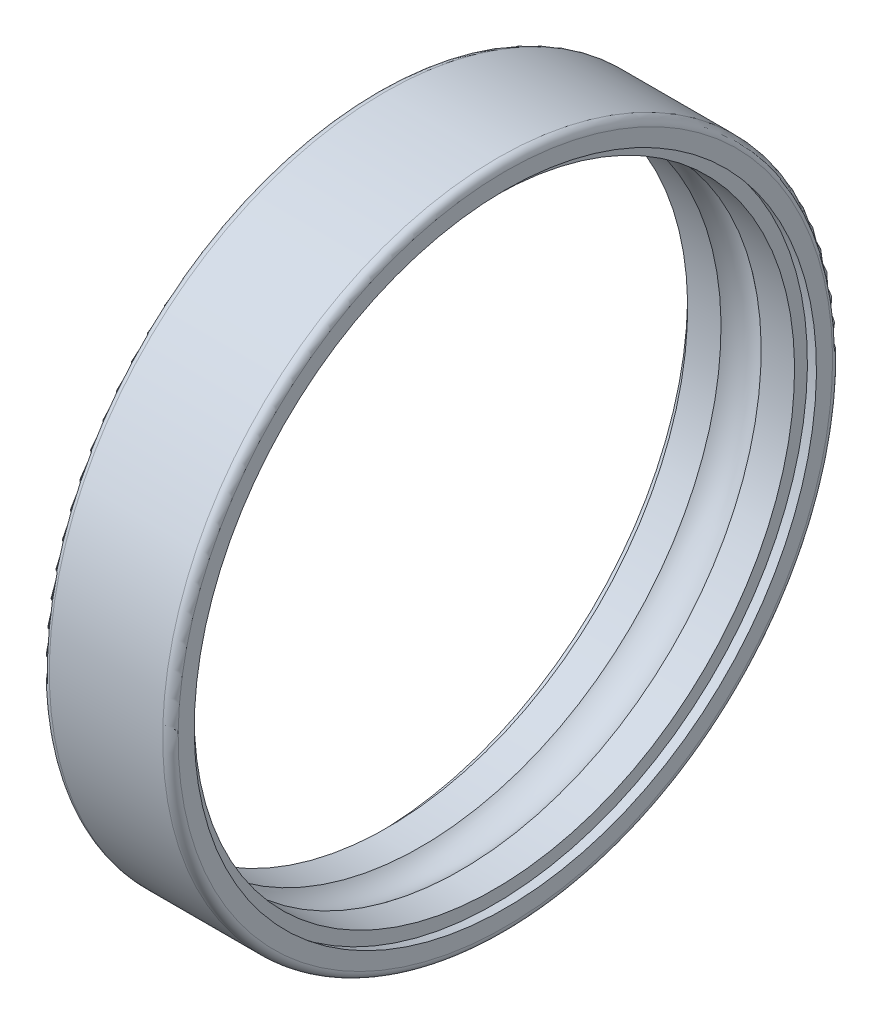
ISO-10303-21;
HEADER;
FILE_DESCRIPTION(('STEP AP214'),'2;1');
FILE_NAME('part.step','',(''),(''),'','','');
FILE_SCHEMA(('AUTOMOTIVE_DESIGN { 1 0 10303 214 1 1 1 1 }'));
ENDSEC;
DATA;
#1=APPLICATION_CONTEXT('core data for automotive mechanical design processes');
#2=APPLICATION_PROTOCOL_DEFINITION('international standard','automotive_design',2000,#1);
#3=PRODUCT_CONTEXT('',#1,'mechanical');
#4=PRODUCT('Part','Part','',(#3));
#5=PRODUCT_RELATED_PRODUCT_CATEGORY('part','',(#4));
#6=PRODUCT_DEFINITION_FORMATION('','',#4);
#7=PRODUCT_DEFINITION_CONTEXT('part definition',#1,'design');
#8=PRODUCT_DEFINITION('design','',#6,#7);
#9=PRODUCT_DEFINITION_SHAPE('','',#8);
#10=(LENGTH_UNIT() NAMED_UNIT(*) SI_UNIT(.MILLI.,.METRE.));
#11=(NAMED_UNIT(*) PLANE_ANGLE_UNIT() SI_UNIT($,.RADIAN.));
#12=(NAMED_UNIT(*) SI_UNIT($,.STERADIAN.) SOLID_ANGLE_UNIT());
#13=UNCERTAINTY_MEASURE_WITH_UNIT(LENGTH_MEASURE(1.E-05),#10,'distance_accuracy_value','');
#14=(GEOMETRIC_REPRESENTATION_CONTEXT(3) GLOBAL_UNCERTAINTY_ASSIGNED_CONTEXT((#13)) GLOBAL_UNIT_ASSIGNED_CONTEXT((#10,
#11,#12)) REPRESENTATION_CONTEXT('',''));
#15=CARTESIAN_POINT('',(0.,0.,0.));
#16=DIRECTION('',(0.,0.,1.));
#17=DIRECTION('',(1.,0.,0.));
#18=AXIS2_PLACEMENT_3D('',#15,#16,#17);
#19=CARTESIAN_POINT('',(3.92714414855095,0.,0.));
#20=DIRECTION('',(-1.,0.,0.));
#21=DIRECTION('',(0.,1.,0.));
#22=AXIS2_PLACEMENT_3D('',#19,#20,#21);
#23=CYLINDRICAL_SURFACE('',#22,11.65);
#24=CARTESIAN_POINT('',(4.575,0.,0.));
#25=DIRECTION('',(1.,0.,0.));
#26=DIRECTION('',(0.,1.,0.));
#27=AXIS2_PLACEMENT_3D('',#24,#25,#26);
#28=CIRCLE('',#27,11.65);
#29=CARTESIAN_POINT('',(4.575,11.65,0.));
#30=VERTEX_POINT('',#29);
#31=EDGE_CURVE('E11',#30,#30,#28,.T.);
#32=ORIENTED_EDGE('',*,*,#31,.T.);
#33=EDGE_LOOP('',(#32));
#34=FACE_BOUND('',#33,.T.);
#35=CARTESIAN_POINT('',(3.27928829710191,0.,0.));
#36=DIRECTION('',(1.,0.,0.));
#37=DIRECTION('',(0.,1.,0.));
#38=AXIS2_PLACEMENT_3D('',#35,#36,#37);
#39=CIRCLE('',#38,11.65);
#40=CARTESIAN_POINT('',(3.27928829710191,11.65,0.));
#41=VERTEX_POINT('',#40);
#42=EDGE_CURVE('E20',#41,#41,#39,.T.);
#43=ORIENTED_EDGE('',*,*,#42,.F.);
#44=EDGE_LOOP('',(#43));
#45=FACE_BOUND('',#44,.T.);
#46=ADVANCED_FACE('F16',(#34,#45),#23,.F.);
#47=CARTESIAN_POINT('',(4.575,11.8999694834005,0.));
#48=DIRECTION('',(1.,0.,0.));
#49=DIRECTION('',(0.,1.,0.));
#50=AXIS2_PLACEMENT_3D('',#47,#48,#49);
#51=PLANE('',#50);
#52=CARTESIAN_POINT('',(4.575,0.,0.));
#53=DIRECTION('',(1.,0.,0.));
#54=DIRECTION('',(0.,1.,0.));
#55=AXIS2_PLACEMENT_3D('',#52,#53,#54);
#56=CIRCLE('',#55,12.1499389668011);
#57=CARTESIAN_POINT('',(4.575,12.1499389668011,0.));
#58=VERTEX_POINT('',#57);
#59=EDGE_CURVE('E26',#58,#58,#56,.T.);
#60=ORIENTED_EDGE('',*,*,#59,.T.);
#61=EDGE_LOOP('',(#60));
#62=FACE_BOUND('',#61,.T.);
#63=ORIENTED_EDGE('',*,*,#31,.F.);
#64=EDGE_LOOP('',(#63));
#65=FACE_BOUND('',#64,.T.);
#66=ADVANCED_FACE('F113',(#62,#65),#51,.T.);
#67=CARTESIAN_POINT('',(4.7875,0.,0.));
#68=DIRECTION('',(-1.,0.,0.));
#69=DIRECTION('',(0.,1.,0.));
#70=AXIS2_PLACEMENT_3D('',#67,#68,#69);
#71=CONICAL_SURFACE('',#70,12.1124694834005,0.174532925199428);
#72=CARTESIAN_POINT('',(5.,0.,0.));
#73=DIRECTION('',(1.,0.,0.));
#74=DIRECTION('',(0.,1.,0.));
#75=AXIS2_PLACEMENT_3D('',#72,#73,#74);
#76=CIRCLE('',#75,12.075);
#77=CARTESIAN_POINT('',(5.,12.075,0.));
#78=VERTEX_POINT('',#77);
#79=EDGE_CURVE('E71',#78,#78,#76,.T.);
#80=ORIENTED_EDGE('',*,*,#79,.T.);
#81=EDGE_LOOP('',(#80));
#82=FACE_BOUND('',#81,.T.);
#83=ORIENTED_EDGE('',*,*,#59,.F.);
#84=EDGE_LOOP('',(#83));
#85=FACE_BOUND('',#84,.T.);
#86=ADVANCED_FACE('F72',(#82,#85),#71,.F.);
#87=CARTESIAN_POINT('',(5.,12.3875,0.));
#88=DIRECTION('',(1.,0.,0.));
#89=DIRECTION('',(0.,1.,0.));
#90=AXIS2_PLACEMENT_3D('',#87,#88,#89);
#91=PLANE('',#90);
#92=CARTESIAN_POINT('',(5.,0.,0.));
#93=DIRECTION('',(1.,0.,0.));
#94=DIRECTION('',(0.,1.,0.));
#95=AXIS2_PLACEMENT_3D('',#92,#93,#94);
#96=CIRCLE('',#95,12.7);
#97=CARTESIAN_POINT('',(5.,12.7,0.));
#98=VERTEX_POINT('',#97);
#99=EDGE_CURVE('E67',#98,#98,#96,.T.);
#100=ORIENTED_EDGE('',*,*,#99,.T.);
#101=EDGE_LOOP('',(#100));
#102=FACE_BOUND('',#101,.T.);
#103=ORIENTED_EDGE('',*,*,#79,.F.);
#104=EDGE_LOOP('',(#103));
#105=FACE_BOUND('',#104,.T.);
#106=ADVANCED_FACE('F109',(#102,#105),#91,.T.);
#107=CARTESIAN_POINT('',(4.7,0.,0.));
#108=DIRECTION('',(1.,0.,0.));
#109=DIRECTION('',(0.,0.,-1.));
#110=AXIS2_PLACEMENT_3D('',#107,#108,#109);
#111=TOROIDAL_SURFACE('',#110,12.7,0.3);
#112=CARTESIAN_POINT('',(4.7,0.,0.));
#113=DIRECTION('',(1.,0.,0.));
#114=DIRECTION('',(0.,1.,0.));
#115=AXIS2_PLACEMENT_3D('',#112,#113,#114);
#116=CIRCLE('',#115,13.);
#117=CARTESIAN_POINT('',(4.7,13.,0.));
#118=VERTEX_POINT('',#117);
#119=EDGE_CURVE('E77',#118,#118,#116,.T.);
#120=ORIENTED_EDGE('',*,*,#119,.T.);
#121=EDGE_LOOP('',(#120));
#122=FACE_BOUND('',#121,.T.);
#123=ORIENTED_EDGE('',*,*,#99,.F.);
#124=EDGE_LOOP('',(#123));
#125=FACE_BOUND('',#124,.T.);
#126=ADVANCED_FACE('F18',(#122,#125),#111,.T.);
#127=CARTESIAN_POINT('',(2.5,0.,0.));
#128=DIRECTION('',(-1.,0.,0.));
#129=DIRECTION('',(0.,1.,0.));
#130=AXIS2_PLACEMENT_3D('',#127,#128,#129);
#131=CYLINDRICAL_SURFACE('',#130,13.);
#132=CARTESIAN_POINT('',(0.3,0.,0.));
#133=DIRECTION('',(1.,0.,0.));
#134=DIRECTION('',(0.,1.,0.));
#135=AXIS2_PLACEMENT_3D('',#132,#133,#134);
#136=CIRCLE('',#135,13.);
#137=CARTESIAN_POINT('',(0.3,13.,0.));
#138=VERTEX_POINT('',#137);
#139=EDGE_CURVE('E84',#138,#138,#136,.T.);
#140=ORIENTED_EDGE('',*,*,#139,.T.);
#141=EDGE_LOOP('',(#140));
#142=FACE_BOUND('',#141,.T.);
#143=ORIENTED_EDGE('',*,*,#119,.F.);
#144=EDGE_LOOP('',(#143));
#145=FACE_BOUND('',#144,.T.);
#146=ADVANCED_FACE('F98',(#142,#145),#131,.T.);
#147=CARTESIAN_POINT('',(0.3,0.,0.));
#148=DIRECTION('',(1.,0.,0.));
#149=DIRECTION('',(0.,0.,-1.));
#150=AXIS2_PLACEMENT_3D('',#147,#148,#149);
#151=TOROIDAL_SURFACE('',#150,12.7,0.3);
#152=CARTESIAN_POINT('',(0.,0.,0.));
#153=DIRECTION('',(1.,0.,0.));
#154=DIRECTION('',(0.,1.,0.));
#155=AXIS2_PLACEMENT_3D('',#152,#153,#154);
#156=CIRCLE('',#155,12.7);
#157=CARTESIAN_POINT('',(0.,12.7,0.));
#158=VERTEX_POINT('',#157);
#159=EDGE_CURVE('E83',#158,#158,#156,.T.);
#160=ORIENTED_EDGE('',*,*,#159,.T.);
#161=EDGE_LOOP('',(#160));
#162=FACE_BOUND('',#161,.T.);
#163=ORIENTED_EDGE('',*,*,#139,.F.);
#164=EDGE_LOOP('',(#163));
#165=FACE_BOUND('',#164,.T.);
#166=ADVANCED_FACE('F100',(#162,#165),#151,.T.);
#167=CARTESIAN_POINT('',(0.,12.3875,0.));
#168=DIRECTION('',(-1.,0.,0.));
#169=DIRECTION('',(0.,-1.,0.));
#170=AXIS2_PLACEMENT_3D('',#167,#168,#169);
#171=PLANE('',#170);
#172=CARTESIAN_POINT('',(0.,0.,0.));
#173=DIRECTION('',(1.,0.,0.));
#174=DIRECTION('',(0.,1.,0.));
#175=AXIS2_PLACEMENT_3D('',#172,#173,#174);
#176=CIRCLE('',#175,12.075);
#177=CARTESIAN_POINT('',(0.,12.075,0.));
#178=VERTEX_POINT('',#177);
#179=EDGE_CURVE('E82',#178,#178,#176,.T.);
#180=ORIENTED_EDGE('',*,*,#179,.T.);
#181=EDGE_LOOP('',(#180));
#182=FACE_BOUND('',#181,.T.);
#183=ORIENTED_EDGE('',*,*,#159,.F.);
#184=EDGE_LOOP('',(#183));
#185=FACE_BOUND('',#184,.T.);
#186=ADVANCED_FACE('F108',(#182,#185),#171,.T.);
#187=CARTESIAN_POINT('',(0.2125,0.,0.));
#188=DIRECTION('',(1.,0.,0.));
#189=DIRECTION('',(0.,1.,0.));
#190=AXIS2_PLACEMENT_3D('',#187,#188,#189);
#191=CONICAL_SURFACE('',#190,12.1124694834005,0.174532925199428);
#192=CARTESIAN_POINT('',(0.425,0.,0.));
#193=DIRECTION('',(1.,0.,0.));
#194=DIRECTION('',(0.,1.,0.));
#195=AXIS2_PLACEMENT_3D('',#192,#193,#194);
#196=CIRCLE('',#195,12.1499389668011);
#197=CARTESIAN_POINT('',(0.425,12.1499389668011,0.));
#198=VERTEX_POINT('',#197);
#199=EDGE_CURVE('E80',#198,#198,#196,.T.);
#200=ORIENTED_EDGE('',*,*,#199,.T.);
#201=EDGE_LOOP('',(#200));
#202=FACE_BOUND('',#201,.T.);
#203=ORIENTED_EDGE('',*,*,#179,.F.);
#204=EDGE_LOOP('',(#203));
#205=FACE_BOUND('',#204,.T.);
#206=ADVANCED_FACE('F128',(#202,#205),#191,.F.);
#207=CARTESIAN_POINT('',(0.425,11.8999694834005,0.));
#208=DIRECTION('',(-1.,0.,0.));
#209=DIRECTION('',(0.,-1.,0.));
#210=AXIS2_PLACEMENT_3D('',#207,#208,#209);
#211=PLANE('',#210);
#212=CARTESIAN_POINT('',(0.425,0.,0.));
#213=DIRECTION('',(1.,0.,0.));
#214=DIRECTION('',(0.,1.,0.));
#215=AXIS2_PLACEMENT_3D('',#212,#213,#214);
#216=CIRCLE('',#215,11.65);
#217=CARTESIAN_POINT('',(0.425,11.65,0.));
#218=VERTEX_POINT('',#217);
#219=EDGE_CURVE('E49',#218,#218,#216,.T.);
#220=ORIENTED_EDGE('',*,*,#219,.T.);
#221=EDGE_LOOP('',(#220));
#222=FACE_BOUND('',#221,.T.);
#223=ORIENTED_EDGE('',*,*,#199,.F.);
#224=EDGE_LOOP('',(#223));
#225=FACE_BOUND('',#224,.T.);
#226=ADVANCED_FACE('F126',(#222,#225),#211,.T.);
#227=CARTESIAN_POINT('',(1.07285585144904,0.,0.));
#228=DIRECTION('',(-1.,0.,0.));
#229=DIRECTION('',(0.,1.,0.));
#230=AXIS2_PLACEMENT_3D('',#227,#228,#229);
#231=CYLINDRICAL_SURFACE('',#230,11.65);
#232=CARTESIAN_POINT('',(1.72071170289809,0.,0.));
#233=DIRECTION('',(1.,0.,0.));
#234=DIRECTION('',(0.,1.,0.));
#235=AXIS2_PLACEMENT_3D('',#232,#233,#234);
#236=CIRCLE('',#235,11.65);
#237=CARTESIAN_POINT('',(1.72071170289809,11.65,0.));
#238=VERTEX_POINT('',#237);
#239=EDGE_CURVE('E93',#238,#238,#236,.T.);
#240=ORIENTED_EDGE('',*,*,#239,.T.);
#241=EDGE_LOOP('',(#240));
#242=FACE_BOUND('',#241,.T.);
#243=ORIENTED_EDGE('',*,*,#219,.F.);
#244=EDGE_LOOP('',(#243));
#245=FACE_BOUND('',#244,.T.);
#246=ADVANCED_FACE('F125',(#242,#245),#231,.F.);
#247=CARTESIAN_POINT('',(2.5,0.,0.));
#248=DIRECTION('',(1.,0.,0.));
#249=DIRECTION('',(0.,0.,-1.));
#250=AXIS2_PLACEMENT_3D('',#247,#248,#249);
#251=TOROIDAL_SURFACE('',#250,10.75,1.1905);
#252=ORIENTED_EDGE('',*,*,#42,.T.);
#253=EDGE_LOOP('',(#252));
#254=FACE_BOUND('',#253,.T.);
#255=ORIENTED_EDGE('',*,*,#239,.F.);
#256=EDGE_LOOP('',(#255));
#257=FACE_BOUND('',#256,.T.);
#258=ADVANCED_FACE('F122',(#254,#257),#251,.F.);
#259=CLOSED_SHELL('',(#46,#66,#86,#106,#126,#146,#166,#186,#206,#226,#246,#258));
#260=MANIFOLD_SOLID_BREP('B1',#259);
#261=ADVANCED_BREP_SHAPE_REPRESENTATION('',(#18,#260),#14);
#262=SHAPE_DEFINITION_REPRESENTATION(#9,#261);
ENDSEC;
END-ISO-10303-21;
